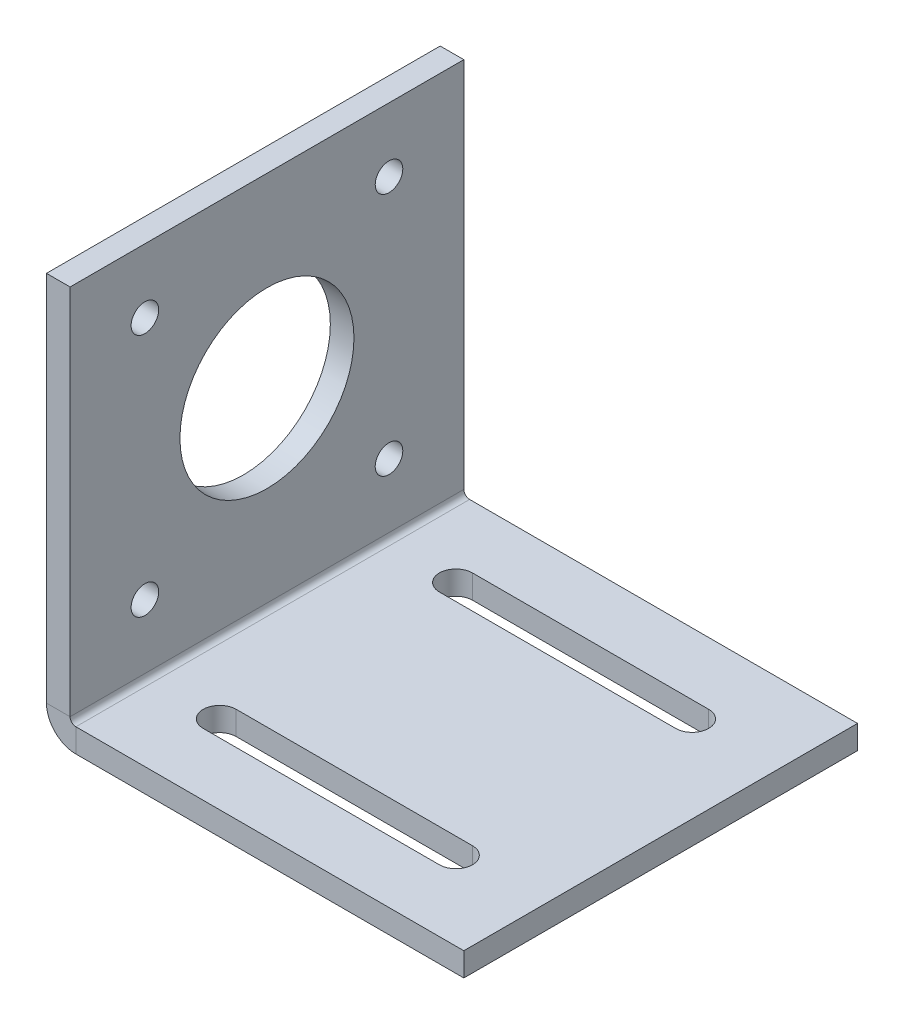
ISO-10303-21;
HEADER;
FILE_DESCRIPTION(('STEP AP214'),'2;1');
FILE_NAME('part.step','',(''),(''),'','','');
FILE_SCHEMA(('AUTOMOTIVE_DESIGN { 1 0 10303 214 1 1 1 1 }'));
ENDSEC;
DATA;
#1=APPLICATION_CONTEXT('core data for automotive mechanical design processes');
#2=APPLICATION_PROTOCOL_DEFINITION('international standard','automotive_design',2000,#1);
#3=PRODUCT_CONTEXT('',#1,'mechanical');
#4=PRODUCT('Part','Part','',(#3));
#5=PRODUCT_RELATED_PRODUCT_CATEGORY('part','',(#4));
#6=PRODUCT_DEFINITION_FORMATION('','',#4);
#7=PRODUCT_DEFINITION_CONTEXT('part definition',#1,'design');
#8=PRODUCT_DEFINITION('design','',#6,#7);
#9=PRODUCT_DEFINITION_SHAPE('','',#8);
#10=(LENGTH_UNIT() NAMED_UNIT(*) SI_UNIT(.MILLI.,.METRE.));
#11=(NAMED_UNIT(*) PLANE_ANGLE_UNIT() SI_UNIT($,.RADIAN.));
#12=(NAMED_UNIT(*) SI_UNIT($,.STERADIAN.) SOLID_ANGLE_UNIT());
#13=UNCERTAINTY_MEASURE_WITH_UNIT(LENGTH_MEASURE(1.E-05),#10,'distance_accuracy_value','');
#14=(GEOMETRIC_REPRESENTATION_CONTEXT(3) GLOBAL_UNCERTAINTY_ASSIGNED_CONTEXT((#13)) GLOBAL_UNIT_ASSIGNED_CONTEXT((#10,
#11,#12)) REPRESENTATION_CONTEXT('',''));
#15=CARTESIAN_POINT('',(0.,0.,0.));
#16=DIRECTION('',(0.,0.,1.));
#17=DIRECTION('',(1.,0.,0.));
#18=AXIS2_PLACEMENT_3D('',#15,#16,#17);
#19=CARTESIAN_POINT('',(0.7366,0.,50.));
#20=DIRECTION('',(0.,0.,1.));
#21=DIRECTION('',(1.,0.,0.));
#22=AXIS2_PLACEMENT_3D('',#19,#20,#21);
#23=PLANE('',#22);
#24=DIRECTION('',(0.,-1.,0.));
#25=VECTOR('',#24,1.);
#26=CARTESIAN_POINT('',(0.7366,0.,50.));
#27=LINE('',#26,#25);
#28=CARTESIAN_POINT('',(0.7366,0.,50.));
#29=VERTEX_POINT('',#28);
#30=CARTESIAN_POINT('',(0.7366,-3.,50.));
#31=VERTEX_POINT('',#30);
#32=EDGE_CURVE('E11',#29,#31,#27,.T.);
#33=ORIENTED_EDGE('',*,*,#32,.F.);
#34=CARTESIAN_POINT('',(0.7366,0.7366,50.));
#35=DIRECTION('',(0.,0.,-1.));
#36=DIRECTION('',(-1.,0.,0.));
#37=AXIS2_PLACEMENT_3D('',#34,#35,#36);
#38=CIRCLE('',#37,0.7366);
#39=CARTESIAN_POINT('',(0.,0.7366,50.));
#40=VERTEX_POINT('',#39);
#41=EDGE_CURVE('E245',#40,#29,#38,.F.);
#42=ORIENTED_EDGE('',*,*,#41,.F.);
#43=DIRECTION('',(1.,0.,0.));
#44=VECTOR('',#43,1.);
#45=CARTESIAN_POINT('',(-3.,0.7366,50.));
#46=LINE('',#45,#44);
#47=CARTESIAN_POINT('',(-3.,0.7366,50.));
#48=VERTEX_POINT('',#47);
#49=EDGE_CURVE('E45',#48,#40,#46,.T.);
#50=ORIENTED_EDGE('',*,*,#49,.F.);
#51=CARTESIAN_POINT('',(0.7366,0.7366,50.));
#52=DIRECTION('',(0.,0.,1.));
#53=DIRECTION('',(1.,0.,0.));
#54=AXIS2_PLACEMENT_3D('',#51,#52,#53);
#55=CIRCLE('',#54,3.7366);
#56=EDGE_CURVE('E257',#48,#31,#55,.T.);
#57=ORIENTED_EDGE('',*,*,#56,.T.);
#58=EDGE_LOOP('',(#33,#42,#50,#57));
#59=FACE_BOUND('',#58,.T.);
#60=ADVANCED_FACE('F37',(#59),#23,.T.);
#61=CARTESIAN_POINT('',(-3.,0.7366,50.));
#62=DIRECTION('',(0.,0.,1.));
#63=DIRECTION('',(1.,0.,0.));
#64=AXIS2_PLACEMENT_3D('',#61,#62,#63);
#65=PLANE('',#64);
#66=DIRECTION('',(1.,0.,0.));
#67=VECTOR('',#66,1.);
#68=CARTESIAN_POINT('',(0.,0.,50.));
#69=LINE('',#68,#67);
#70=CARTESIAN_POINT('',(50.,0.,50.));
#71=VERTEX_POINT('',#70);
#72=EDGE_CURVE('E242',#29,#71,#69,.T.);
#73=ORIENTED_EDGE('',*,*,#72,.F.);
#74=ORIENTED_EDGE('',*,*,#32,.T.);
#75=DIRECTION('',(1.,0.,0.));
#76=VECTOR('',#75,1.);
#77=CARTESIAN_POINT('',(0.,-3.,50.));
#78=LINE('',#77,#76);
#79=CARTESIAN_POINT('',(50.,-3.,50.));
#80=VERTEX_POINT('',#79);
#81=EDGE_CURVE('E236',#31,#80,#78,.T.);
#82=ORIENTED_EDGE('',*,*,#81,.T.);
#83=DIRECTION('',(0.,-1.,0.));
#84=VECTOR('',#83,1.);
#85=CARTESIAN_POINT('',(50.,0.,50.));
#86=LINE('',#85,#84);
#87=EDGE_CURVE('E238',#71,#80,#86,.T.);
#88=ORIENTED_EDGE('',*,*,#87,.F.);
#89=EDGE_LOOP('',(#73,#74,#82,#88));
#90=FACE_BOUND('',#89,.T.);
#91=ADVANCED_FACE('F340',(#90),#65,.T.);
#92=CARTESIAN_POINT('',(0.,0.7366,0.));
#93=DIRECTION('',(0.,0.,-1.));
#94=DIRECTION('',(-1.,0.,0.));
#95=AXIS2_PLACEMENT_3D('',#92,#93,#94);
#96=PLANE('',#95);
#97=DIRECTION('',(-1.,0.,0.));
#98=VECTOR('',#97,1.);
#99=CARTESIAN_POINT('',(0.,0.7366,0.));
#100=LINE('',#99,#98);
#101=CARTESIAN_POINT('',(0.,0.7366,0.));
#102=VERTEX_POINT('',#101);
#103=CARTESIAN_POINT('',(-3.,0.7366,0.));
#104=VERTEX_POINT('',#103);
#105=EDGE_CURVE('E305',#102,#104,#100,.T.);
#106=ORIENTED_EDGE('',*,*,#105,.F.);
#107=CARTESIAN_POINT('',(0.7366,0.7366,0.));
#108=DIRECTION('',(0.,0.,-1.));
#109=DIRECTION('',(-1.,0.,0.));
#110=AXIS2_PLACEMENT_3D('',#107,#108,#109);
#111=CIRCLE('',#110,0.7366);
#112=CARTESIAN_POINT('',(0.7366,0.,0.));
#113=VERTEX_POINT('',#112);
#114=EDGE_CURVE('E270',#102,#113,#111,.F.);
#115=ORIENTED_EDGE('',*,*,#114,.T.);
#116=DIRECTION('',(0.,1.,0.));
#117=VECTOR('',#116,1.);
#118=CARTESIAN_POINT('',(0.7366,-3.,0.));
#119=LINE('',#118,#117);
#120=CARTESIAN_POINT('',(0.7366,-3.,0.));
#121=VERTEX_POINT('',#120);
#122=EDGE_CURVE('E303',#121,#113,#119,.T.);
#123=ORIENTED_EDGE('',*,*,#122,.F.);
#124=CARTESIAN_POINT('',(0.7366,0.7366,0.));
#125=DIRECTION('',(0.,0.,1.));
#126=DIRECTION('',(1.,0.,0.));
#127=AXIS2_PLACEMENT_3D('',#124,#125,#126);
#128=CIRCLE('',#127,3.7366);
#129=EDGE_CURVE('E239',#104,#121,#128,.T.);
#130=ORIENTED_EDGE('',*,*,#129,.F.);
#131=EDGE_LOOP('',(#106,#115,#123,#130));
#132=FACE_BOUND('',#131,.T.);
#133=ADVANCED_FACE('F345',(#132),#96,.T.);
#134=CARTESIAN_POINT('',(0.7366,-3.,0.));
#135=DIRECTION('',(0.,0.,-1.));
#136=DIRECTION('',(-1.,0.,0.));
#137=AXIS2_PLACEMENT_3D('',#134,#135,#136);
#138=PLANE('',#137);
#139=DIRECTION('',(0.,-1.,0.));
#140=VECTOR('',#139,1.);
#141=CARTESIAN_POINT('',(0.,0.,0.));
#142=LINE('',#141,#140);
#143=CARTESIAN_POINT('',(0.,48.,0.));
#144=VERTEX_POINT('',#143);
#145=EDGE_CURVE('E273',#144,#102,#142,.T.);
#146=ORIENTED_EDGE('',*,*,#145,.T.);
#147=ORIENTED_EDGE('',*,*,#105,.T.);
#148=DIRECTION('',(0.,1.,0.));
#149=VECTOR('',#148,1.);
#150=CARTESIAN_POINT('',(-3.,0.,0.));
#151=LINE('',#150,#149);
#152=CARTESIAN_POINT('',(-3.,48.,0.));
#153=VERTEX_POINT('',#152);
#154=EDGE_CURVE('E279',#153,#104,#151,.F.);
#155=ORIENTED_EDGE('',*,*,#154,.F.);
#156=DIRECTION('',(1.,0.,0.));
#157=VECTOR('',#156,1.);
#158=CARTESIAN_POINT('',(-3.,48.,0.));
#159=LINE('',#158,#157);
#160=EDGE_CURVE('E276',#153,#144,#159,.T.);
#161=ORIENTED_EDGE('',*,*,#160,.T.);
#162=EDGE_LOOP('',(#146,#147,#155,#161));
#163=FACE_BOUND('',#162,.T.);
#164=ADVANCED_FACE('F388',(#163),#138,.T.);
#165=CARTESIAN_POINT('',(0.,-3.,50.));
#166=DIRECTION('',(0.,1.,0.));
#167=DIRECTION('',(0.,0.,1.));
#168=AXIS2_PLACEMENT_3D('',#165,#166,#167);
#169=PLANE('',#168);
#170=DIRECTION('',(1.,0.,0.));
#171=VECTOR('',#170,1.);
#172=CARTESIAN_POINT('',(0.,-3.,12.1));
#173=LINE('',#172,#171);
#174=CARTESIAN_POINT('',(9.00000000000001,-3.,12.1));
#175=VERTEX_POINT('',#174);
#176=CARTESIAN_POINT('',(39.,-3.,12.1));
#177=VERTEX_POINT('',#176);
#178=EDGE_CURVE('E181',#175,#177,#173,.T.);
#179=ORIENTED_EDGE('',*,*,#178,.T.);
#180=CARTESIAN_POINT('',(39.,-3.,10.));
#181=DIRECTION('',(0.,1.,0.));
#182=DIRECTION('',(0.,0.,1.));
#183=AXIS2_PLACEMENT_3D('',#180,#181,#182);
#184=CIRCLE('',#183,2.1);
#185=CARTESIAN_POINT('',(39.,-3.,7.9));
#186=VERTEX_POINT('',#185);
#187=EDGE_CURVE('E184',#177,#186,#184,.T.);
#188=ORIENTED_EDGE('',*,*,#187,.T.);
#189=DIRECTION('',(-1.,0.,0.));
#190=VECTOR('',#189,1.);
#191=CARTESIAN_POINT('',(0.,-3.,7.9));
#192=LINE('',#191,#190);
#193=CARTESIAN_POINT('',(9.00000000000001,-3.,7.9));
#194=VERTEX_POINT('',#193);
#195=EDGE_CURVE('E176',#186,#194,#192,.T.);
#196=ORIENTED_EDGE('',*,*,#195,.T.);
#197=CARTESIAN_POINT('',(9.00000000000001,-3.,10.));
#198=DIRECTION('',(0.,1.,0.));
#199=DIRECTION('',(0.,0.,1.));
#200=AXIS2_PLACEMENT_3D('',#197,#198,#199);
#201=CIRCLE('',#200,2.1);
#202=EDGE_CURVE('E156',#194,#175,#201,.T.);
#203=ORIENTED_EDGE('',*,*,#202,.T.);
#204=EDGE_LOOP('',(#179,#188,#196,#203));
#205=FACE_BOUND('',#204,.T.);
#206=DIRECTION('',(-1.,0.,0.));
#207=VECTOR('',#206,1.);
#208=CARTESIAN_POINT('',(0.,-3.,37.9));
#209=LINE('',#208,#207);
#210=CARTESIAN_POINT('',(39.,-3.,37.9));
#211=VERTEX_POINT('',#210);
#212=CARTESIAN_POINT('',(9.00000000000001,-3.,37.9));
#213=VERTEX_POINT('',#212);
#214=EDGE_CURVE('E213',#211,#213,#209,.T.);
#215=ORIENTED_EDGE('',*,*,#214,.T.);
#216=CARTESIAN_POINT('',(9.00000000000001,-3.,40.));
#217=DIRECTION('',(0.,1.,0.));
#218=DIRECTION('',(0.,0.,1.));
#219=AXIS2_PLACEMENT_3D('',#216,#217,#218);
#220=CIRCLE('',#219,2.1);
#221=CARTESIAN_POINT('',(9.00000000000001,-3.,42.1));
#222=VERTEX_POINT('',#221);
#223=EDGE_CURVE('E216',#213,#222,#220,.T.);
#224=ORIENTED_EDGE('',*,*,#223,.T.);
#225=DIRECTION('',(1.,0.,0.));
#226=VECTOR('',#225,1.);
#227=CARTESIAN_POINT('',(0.,-3.,42.1));
#228=LINE('',#227,#226);
#229=CARTESIAN_POINT('',(39.,-3.,42.1));
#230=VERTEX_POINT('',#229);
#231=EDGE_CURVE('E201',#222,#230,#228,.T.);
#232=ORIENTED_EDGE('',*,*,#231,.T.);
#233=CARTESIAN_POINT('',(39.,-3.,40.));
#234=DIRECTION('',(0.,1.,0.));
#235=DIRECTION('',(0.,0.,1.));
#236=AXIS2_PLACEMENT_3D('',#233,#234,#235);
#237=CIRCLE('',#236,2.1);
#238=EDGE_CURVE('E210',#230,#211,#237,.T.);
#239=ORIENTED_EDGE('',*,*,#238,.T.);
#240=EDGE_LOOP('',(#215,#224,#232,#239));
#241=FACE_BOUND('',#240,.T.);
#242=DIRECTION('',(1.,0.,0.));
#243=VECTOR('',#242,1.);
#244=CARTESIAN_POINT('',(0.,-3.,0.));
#245=LINE('',#244,#243);
#246=CARTESIAN_POINT('',(50.,-3.,0.));
#247=VERTEX_POINT('',#246);
#248=EDGE_CURVE('E261',#121,#247,#245,.T.);
#249=ORIENTED_EDGE('',*,*,#248,.T.);
#250=DIRECTION('',(0.,0.,-1.));
#251=VECTOR('',#250,1.);
#252=CARTESIAN_POINT('',(50.,-3.,50.));
#253=LINE('',#252,#251);
#254=EDGE_CURVE('E301',#80,#247,#253,.T.);
#255=ORIENTED_EDGE('',*,*,#254,.F.);
#256=ORIENTED_EDGE('',*,*,#81,.F.);
#257=DIRECTION('',(0.,0.,-1.));
#258=VECTOR('',#257,1.);
#259=CARTESIAN_POINT('',(0.7366,-3.,50.));
#260=LINE('',#259,#258);
#261=EDGE_CURVE('E260',#31,#121,#260,.T.);
#262=ORIENTED_EDGE('',*,*,#261,.T.);
#263=EDGE_LOOP('',(#249,#255,#256,#262));
#264=FACE_BOUND('',#263,.T.);
#265=ADVANCED_FACE('F380',(#205,#241,#264),#169,.F.);
#266=CARTESIAN_POINT('',(50.,0.,50.));
#267=DIRECTION('',(1.,0.,0.));
#268=DIRECTION('',(0.,0.,-1.));
#269=AXIS2_PLACEMENT_3D('',#266,#267,#268);
#270=PLANE('',#269);
#271=DIRECTION('',(0.,-1.,0.));
#272=VECTOR('',#271,1.);
#273=CARTESIAN_POINT('',(50.,0.,0.));
#274=LINE('',#273,#272);
#275=CARTESIAN_POINT('',(50.,0.,0.));
#276=VERTEX_POINT('',#275);
#277=EDGE_CURVE('E264',#276,#247,#274,.T.);
#278=ORIENTED_EDGE('',*,*,#277,.F.);
#279=DIRECTION('',(0.,0.,-1.));
#280=VECTOR('',#279,1.);
#281=CARTESIAN_POINT('',(50.,0.,50.));
#282=LINE('',#281,#280);
#283=EDGE_CURVE('E299',#71,#276,#282,.T.);
#284=ORIENTED_EDGE('',*,*,#283,.F.);
#285=ORIENTED_EDGE('',*,*,#87,.T.);
#286=ORIENTED_EDGE('',*,*,#254,.T.);
#287=EDGE_LOOP('',(#278,#284,#285,#286));
#288=FACE_BOUND('',#287,.T.);
#289=ADVANCED_FACE('F383',(#288),#270,.T.);
#290=CARTESIAN_POINT('',(0.,0.,50.));
#291=DIRECTION('',(0.,1.,0.));
#292=DIRECTION('',(0.,0.,1.));
#293=AXIS2_PLACEMENT_3D('',#290,#291,#292);
#294=PLANE('',#293);
#295=CARTESIAN_POINT('',(39.,0.,10.));
#296=DIRECTION('',(0.,1.,0.));
#297=DIRECTION('',(0.,0.,-1.));
#298=AXIS2_PLACEMENT_3D('',#295,#296,#297);
#299=CIRCLE('',#298,2.1);
#300=CARTESIAN_POINT('',(39.,0.,12.1));
#301=VERTEX_POINT('',#300);
#302=CARTESIAN_POINT('',(39.,0.,7.9));
#303=VERTEX_POINT('',#302);
#304=EDGE_CURVE('E61',#301,#303,#299,.T.);
#305=ORIENTED_EDGE('',*,*,#304,.F.);
#306=DIRECTION('',(1.,0.,0.));
#307=VECTOR('',#306,1.);
#308=CARTESIAN_POINT('',(9.00000000000001,0.,12.1));
#309=LINE('',#308,#307);
#310=CARTESIAN_POINT('',(9.00000000000001,0.,12.1));
#311=VERTEX_POINT('',#310);
#312=EDGE_CURVE('E169',#311,#301,#309,.T.);
#313=ORIENTED_EDGE('',*,*,#312,.F.);
#314=CARTESIAN_POINT('',(9.00000000000001,0.,10.));
#315=DIRECTION('',(0.,1.,0.));
#316=DIRECTION('',(0.,0.,-1.));
#317=AXIS2_PLACEMENT_3D('',#314,#315,#316);
#318=CIRCLE('',#317,2.1);
#319=CARTESIAN_POINT('',(9.00000000000001,0.,7.9));
#320=VERTEX_POINT('',#319);
#321=EDGE_CURVE('E153',#320,#311,#318,.T.);
#322=ORIENTED_EDGE('',*,*,#321,.F.);
#323=DIRECTION('',(-1.,0.,0.));
#324=VECTOR('',#323,1.);
#325=CARTESIAN_POINT('',(9.00000000000001,0.,7.9));
#326=LINE('',#325,#324);
#327=EDGE_CURVE('E162',#303,#320,#326,.T.);
#328=ORIENTED_EDGE('',*,*,#327,.F.);
#329=EDGE_LOOP('',(#305,#313,#322,#328));
#330=FACE_BOUND('',#329,.T.);
#331=CARTESIAN_POINT('',(9.00000000000001,0.,40.));
#332=DIRECTION('',(0.,1.,0.));
#333=DIRECTION('',(0.,0.,1.));
#334=AXIS2_PLACEMENT_3D('',#331,#332,#333);
#335=CIRCLE('',#334,2.1);
#336=CARTESIAN_POINT('',(9.00000000000001,0.,37.9));
#337=VERTEX_POINT('',#336);
#338=CARTESIAN_POINT('',(9.00000000000001,0.,42.1));
#339=VERTEX_POINT('',#338);
#340=EDGE_CURVE('E187',#337,#339,#335,.T.);
#341=ORIENTED_EDGE('',*,*,#340,.F.);
#342=DIRECTION('',(-1.,0.,0.));
#343=VECTOR('',#342,1.);
#344=CARTESIAN_POINT('',(9.00000000000001,0.,37.9));
#345=LINE('',#344,#343);
#346=CARTESIAN_POINT('',(39.,0.,37.9));
#347=VERTEX_POINT('',#346);
#348=EDGE_CURVE('E195',#347,#337,#345,.T.);
#349=ORIENTED_EDGE('',*,*,#348,.F.);
#350=CARTESIAN_POINT('',(39.,0.,40.));
#351=DIRECTION('',(0.,1.,0.));
#352=DIRECTION('',(0.,0.,1.));
#353=AXIS2_PLACEMENT_3D('',#350,#351,#352);
#354=CIRCLE('',#353,2.1);
#355=CARTESIAN_POINT('',(39.,0.,42.1));
#356=VERTEX_POINT('',#355);
#357=EDGE_CURVE('E192',#356,#347,#354,.T.);
#358=ORIENTED_EDGE('',*,*,#357,.F.);
#359=DIRECTION('',(1.,0.,0.));
#360=VECTOR('',#359,1.);
#361=CARTESIAN_POINT('',(9.00000000000001,0.,42.1));
#362=LINE('',#361,#360);
#363=EDGE_CURVE('E189',#339,#356,#362,.T.);
#364=ORIENTED_EDGE('',*,*,#363,.F.);
#365=EDGE_LOOP('',(#341,#349,#358,#364));
#366=FACE_BOUND('',#365,.T.);
#367=DIRECTION('',(1.,0.,0.));
#368=VECTOR('',#367,1.);
#369=CARTESIAN_POINT('',(0.,0.,0.));
#370=LINE('',#369,#368);
#371=EDGE_CURVE('E267',#113,#276,#370,.T.);
#372=ORIENTED_EDGE('',*,*,#371,.F.);
#373=DIRECTION('',(0.,0.,-1.));
#374=VECTOR('',#373,1.);
#375=CARTESIAN_POINT('',(0.7366,0.,50.));
#376=LINE('',#375,#374);
#377=EDGE_CURVE('E296',#29,#113,#376,.T.);
#378=ORIENTED_EDGE('',*,*,#377,.F.);
#379=ORIENTED_EDGE('',*,*,#72,.T.);
#380=ORIENTED_EDGE('',*,*,#283,.T.);
#381=EDGE_LOOP('',(#372,#378,#379,#380));
#382=FACE_BOUND('',#381,.T.);
#383=ADVANCED_FACE('F166',(#330,#366,#382),#294,.T.);
#384=CARTESIAN_POINT('',(0.7366,0.7366,50.));
#385=DIRECTION('',(0.,0.,-1.));
#386=DIRECTION('',(-1.,0.,0.));
#387=AXIS2_PLACEMENT_3D('',#384,#385,#386);
#388=CYLINDRICAL_SURFACE('',#387,0.7366);
#389=ORIENTED_EDGE('',*,*,#114,.F.);
#390=DIRECTION('',(0.,0.,-1.));
#391=VECTOR('',#390,1.);
#392=CARTESIAN_POINT('',(0.,0.7366,50.));
#393=LINE('',#392,#391);
#394=EDGE_CURVE('E293',#40,#102,#393,.T.);
#395=ORIENTED_EDGE('',*,*,#394,.F.);
#396=ORIENTED_EDGE('',*,*,#41,.T.);
#397=ORIENTED_EDGE('',*,*,#377,.T.);
#398=EDGE_LOOP('',(#389,#395,#396,#397));
#399=FACE_BOUND('',#398,.T.);
#400=ADVANCED_FACE('F358',(#399),#388,.F.);
#401=CARTESIAN_POINT('',(0.,0.,50.));
#402=DIRECTION('',(1.,0.,0.));
#403=DIRECTION('',(0.,0.,-1.));
#404=AXIS2_PLACEMENT_3D('',#401,#402,#403);
#405=PLANE('',#404);
#406=CARTESIAN_POINT('',(0.,39.8683,40.5));
#407=DIRECTION('',(1.,0.,0.));
#408=DIRECTION('',(0.,0.,-1.));
#409=AXIS2_PLACEMENT_3D('',#406,#407,#408);
#410=CIRCLE('',#409,1.75);
#411=CARTESIAN_POINT('',(0.,39.8683,38.75));
#412=VERTEX_POINT('',#411);
#413=EDGE_CURVE('E220',#412,#412,#410,.T.);
#414=ORIENTED_EDGE('',*,*,#413,.F.);
#415=EDGE_LOOP('',(#414));
#416=FACE_BOUND('',#415,.T.);
#417=CARTESIAN_POINT('',(0.,39.8683,9.5));
#418=DIRECTION('',(1.,0.,0.));
#419=DIRECTION('',(0.,0.,1.));
#420=AXIS2_PLACEMENT_3D('',#417,#418,#419);
#421=CIRCLE('',#420,1.75);
#422=CARTESIAN_POINT('',(0.,39.8683,11.25));
#423=VERTEX_POINT('',#422);
#424=EDGE_CURVE('E224',#423,#423,#421,.T.);
#425=ORIENTED_EDGE('',*,*,#424,.F.);
#426=EDGE_LOOP('',(#425));
#427=FACE_BOUND('',#426,.T.);
#428=CARTESIAN_POINT('',(0.,8.8683,40.5));
#429=DIRECTION('',(1.,0.,0.));
#430=DIRECTION('',(0.,0.,1.));
#431=AXIS2_PLACEMENT_3D('',#428,#429,#430);
#432=CIRCLE('',#431,1.75);
#433=CARTESIAN_POINT('',(0.,8.8683,42.25));
#434=VERTEX_POINT('',#433);
#435=EDGE_CURVE('E227',#434,#434,#432,.T.);
#436=ORIENTED_EDGE('',*,*,#435,.F.);
#437=EDGE_LOOP('',(#436));
#438=FACE_BOUND('',#437,.T.);
#439=CARTESIAN_POINT('',(0.,8.8683,9.5));
#440=DIRECTION('',(1.,0.,0.));
#441=DIRECTION('',(0.,0.,-1.));
#442=AXIS2_PLACEMENT_3D('',#439,#440,#441);
#443=CIRCLE('',#442,1.75);
#444=CARTESIAN_POINT('',(0.,8.8683,7.75));
#445=VERTEX_POINT('',#444);
#446=EDGE_CURVE('E219',#445,#445,#443,.T.);
#447=ORIENTED_EDGE('',*,*,#446,.F.);
#448=EDGE_LOOP('',(#447));
#449=FACE_BOUND('',#448,.T.);
#450=CARTESIAN_POINT('',(0.,24.3683,25.));
#451=DIRECTION('',(1.,0.,0.));
#452=DIRECTION('',(0.,0.,-1.));
#453=AXIS2_PLACEMENT_3D('',#450,#451,#452);
#454=CIRCLE('',#453,11.05);
#455=CARTESIAN_POINT('',(0.,24.3683,13.95));
#456=VERTEX_POINT('',#455);
#457=EDGE_CURVE('E232',#456,#456,#454,.T.);
#458=ORIENTED_EDGE('',*,*,#457,.F.);
#459=EDGE_LOOP('',(#458));
#460=FACE_BOUND('',#459,.T.);
#461=ORIENTED_EDGE('',*,*,#145,.F.);
#462=DIRECTION('',(0.,0.,-1.));
#463=VECTOR('',#462,1.);
#464=CARTESIAN_POINT('',(0.,48.,50.));
#465=LINE('',#464,#463);
#466=CARTESIAN_POINT('',(0.,48.,50.));
#467=VERTEX_POINT('',#466);
#468=EDGE_CURVE('E291',#467,#144,#465,.T.);
#469=ORIENTED_EDGE('',*,*,#468,.F.);
#470=DIRECTION('',(0.,-1.,0.));
#471=VECTOR('',#470,1.);
#472=CARTESIAN_POINT('',(0.,0.,50.));
#473=LINE('',#472,#471);
#474=EDGE_CURVE('E248',#467,#40,#473,.T.);
#475=ORIENTED_EDGE('',*,*,#474,.T.);
#476=ORIENTED_EDGE('',*,*,#394,.T.);
#477=EDGE_LOOP('',(#461,#469,#475,#476));
#478=FACE_BOUND('',#477,.T.);
#479=ADVANCED_FACE('F361',(#416,#427,#438,#449,#460,#478),#405,.T.);
#480=CARTESIAN_POINT('',(-3.,48.,50.));
#481=DIRECTION('',(0.,1.,0.));
#482=DIRECTION('',(0.,0.,1.));
#483=AXIS2_PLACEMENT_3D('',#480,#481,#482);
#484=PLANE('',#483);
#485=ORIENTED_EDGE('',*,*,#160,.F.);
#486=DIRECTION('',(0.,0.,-1.));
#487=VECTOR('',#486,1.);
#488=CARTESIAN_POINT('',(-3.,48.,50.));
#489=LINE('',#488,#487);
#490=CARTESIAN_POINT('',(-3.,48.,50.));
#491=VERTEX_POINT('',#490);
#492=EDGE_CURVE('E289',#491,#153,#489,.T.);
#493=ORIENTED_EDGE('',*,*,#492,.F.);
#494=DIRECTION('',(1.,0.,0.));
#495=VECTOR('',#494,1.);
#496=CARTESIAN_POINT('',(-3.,48.,50.));
#497=LINE('',#496,#495);
#498=EDGE_CURVE('E251',#491,#467,#497,.T.);
#499=ORIENTED_EDGE('',*,*,#498,.T.);
#500=ORIENTED_EDGE('',*,*,#468,.T.);
#501=EDGE_LOOP('',(#485,#493,#499,#500));
#502=FACE_BOUND('',#501,.T.);
#503=ADVANCED_FACE('F368',(#502),#484,.T.);
#504=CARTESIAN_POINT('',(-3.,0.,50.));
#505=DIRECTION('',(1.,0.,0.));
#506=DIRECTION('',(0.,0.,-1.));
#507=AXIS2_PLACEMENT_3D('',#504,#505,#506);
#508=PLANE('',#507);
#509=CARTESIAN_POINT('',(-3.,39.8683,40.5));
#510=DIRECTION('',(1.,0.,0.));
#511=DIRECTION('',(0.,0.,-1.));
#512=AXIS2_PLACEMENT_3D('',#509,#510,#511);
#513=CIRCLE('',#512,1.75);
#514=CARTESIAN_POINT('',(-3.,39.8683,38.75));
#515=VERTEX_POINT('',#514);
#516=EDGE_CURVE('E40',#515,#515,#513,.T.);
#517=ORIENTED_EDGE('',*,*,#516,.T.);
#518=EDGE_LOOP('',(#517));
#519=FACE_BOUND('',#518,.T.);
#520=CARTESIAN_POINT('',(-3.,39.8683,9.5));
#521=DIRECTION('',(1.,0.,0.));
#522=DIRECTION('',(0.,0.,-1.));
#523=AXIS2_PLACEMENT_3D('',#520,#521,#522);
#524=CIRCLE('',#523,1.75);
#525=CARTESIAN_POINT('',(-3.,39.8683,7.75));
#526=VERTEX_POINT('',#525);
#527=EDGE_CURVE('E314',#526,#526,#524,.T.);
#528=ORIENTED_EDGE('',*,*,#527,.T.);
#529=EDGE_LOOP('',(#528));
#530=FACE_BOUND('',#529,.T.);
#531=CARTESIAN_POINT('',(-3.,8.8683,40.5));
#532=DIRECTION('',(1.,0.,0.));
#533=DIRECTION('',(0.,0.,-1.));
#534=AXIS2_PLACEMENT_3D('',#531,#532,#533);
#535=CIRCLE('',#534,1.75);
#536=CARTESIAN_POINT('',(-3.,8.8683,38.75));
#537=VERTEX_POINT('',#536);
#538=EDGE_CURVE('E312',#537,#537,#535,.T.);
#539=ORIENTED_EDGE('',*,*,#538,.T.);
#540=EDGE_LOOP('',(#539));
#541=FACE_BOUND('',#540,.T.);
#542=CARTESIAN_POINT('',(-3.,8.8683,9.5));
#543=DIRECTION('',(1.,0.,0.));
#544=DIRECTION('',(0.,0.,-1.));
#545=AXIS2_PLACEMENT_3D('',#542,#543,#544);
#546=CIRCLE('',#545,1.75);
#547=CARTESIAN_POINT('',(-3.,8.8683,7.75));
#548=VERTEX_POINT('',#547);
#549=EDGE_CURVE('E223',#548,#548,#546,.T.);
#550=ORIENTED_EDGE('',*,*,#549,.T.);
#551=EDGE_LOOP('',(#550));
#552=FACE_BOUND('',#551,.T.);
#553=CARTESIAN_POINT('',(-3.,24.3683,25.));
#554=DIRECTION('',(1.,0.,0.));
#555=DIRECTION('',(0.,0.,-1.));
#556=AXIS2_PLACEMENT_3D('',#553,#554,#555);
#557=CIRCLE('',#556,11.05);
#558=CARTESIAN_POINT('',(-3.,24.3683,13.95));
#559=VERTEX_POINT('',#558);
#560=EDGE_CURVE('E235',#559,#559,#557,.T.);
#561=ORIENTED_EDGE('',*,*,#560,.T.);
#562=EDGE_LOOP('',(#561));
#563=FACE_BOUND('',#562,.T.);
#564=ORIENTED_EDGE('',*,*,#154,.T.);
#565=DIRECTION('',(0.,0.,-1.));
#566=VECTOR('',#565,1.);
#567=CARTESIAN_POINT('',(-3.,0.7366,50.));
#568=LINE('',#567,#566);
#569=EDGE_CURVE('E286',#48,#104,#568,.T.);
#570=ORIENTED_EDGE('',*,*,#569,.F.);
#571=DIRECTION('',(0.,1.,0.));
#572=VECTOR('',#571,1.);
#573=CARTESIAN_POINT('',(-3.,0.,50.));
#574=LINE('',#573,#572);
#575=EDGE_CURVE('E254',#491,#48,#574,.F.);
#576=ORIENTED_EDGE('',*,*,#575,.F.);
#577=ORIENTED_EDGE('',*,*,#492,.T.);
#578=EDGE_LOOP('',(#564,#570,#576,#577));
#579=FACE_BOUND('',#578,.T.);
#580=ADVANCED_FACE('F321',(#519,#530,#541,#552,#563,#579),#508,.F.);
#581=CARTESIAN_POINT('',(0.7366,0.7366,50.));
#582=DIRECTION('',(0.,0.,-1.));
#583=DIRECTION('',(-1.,0.,0.));
#584=AXIS2_PLACEMENT_3D('',#581,#582,#583);
#585=CYLINDRICAL_SURFACE('',#584,3.7366);
#586=ORIENTED_EDGE('',*,*,#129,.T.);
#587=ORIENTED_EDGE('',*,*,#261,.F.);
#588=ORIENTED_EDGE('',*,*,#56,.F.);
#589=ORIENTED_EDGE('',*,*,#569,.T.);
#590=EDGE_LOOP('',(#586,#587,#588,#589));
#591=FACE_BOUND('',#590,.T.);
#592=ADVANCED_FACE('F375',(#591),#585,.T.);
#593=CARTESIAN_POINT('',(0.7366,0.7366,50.));
#594=DIRECTION('',(0.,0.,-1.));
#595=DIRECTION('',(-1.,0.,0.));
#596=AXIS2_PLACEMENT_3D('',#593,#594,#595);
#597=PLANE('',#596);
#598=ORIENTED_EDGE('',*,*,#575,.T.);
#599=ORIENTED_EDGE('',*,*,#49,.T.);
#600=ORIENTED_EDGE('',*,*,#474,.F.);
#601=ORIENTED_EDGE('',*,*,#498,.F.);
#602=EDGE_LOOP('',(#598,#599,#600,#601));
#603=FACE_BOUND('',#602,.T.);
#604=ADVANCED_FACE('F365',(#603),#597,.F.);
#605=CARTESIAN_POINT('',(0.7366,0.7366,0.));
#606=DIRECTION('',(0.,0.,-1.));
#607=DIRECTION('',(-1.,0.,0.));
#608=AXIS2_PLACEMENT_3D('',#605,#606,#607);
#609=PLANE('',#608);
#610=ORIENTED_EDGE('',*,*,#248,.F.);
#611=ORIENTED_EDGE('',*,*,#122,.T.);
#612=ORIENTED_EDGE('',*,*,#371,.T.);
#613=ORIENTED_EDGE('',*,*,#277,.T.);
#614=EDGE_LOOP('',(#610,#611,#612,#613));
#615=FACE_BOUND('',#614,.T.);
#616=ADVANCED_FACE('F385',(#615),#609,.T.);
#617=CARTESIAN_POINT('',(-10.,24.3683,25.));
#618=DIRECTION('',(1.,0.,0.));
#619=DIRECTION('',(0.,0.,-1.));
#620=AXIS2_PLACEMENT_3D('',#617,#618,#619);
#621=CYLINDRICAL_SURFACE('',#620,11.05);
#622=ORIENTED_EDGE('',*,*,#457,.T.);
#623=EDGE_LOOP('',(#622));
#624=FACE_BOUND('',#623,.T.);
#625=ORIENTED_EDGE('',*,*,#560,.F.);
#626=EDGE_LOOP('',(#625));
#627=FACE_BOUND('',#626,.T.);
#628=ADVANCED_FACE('F417',(#624,#627),#621,.F.);
#629=CARTESIAN_POINT('',(-10.,8.8683,9.5));
#630=DIRECTION('',(1.,0.,0.));
#631=DIRECTION('',(0.,0.,-1.));
#632=AXIS2_PLACEMENT_3D('',#629,#630,#631);
#633=CYLINDRICAL_SURFACE('',#632,1.75);
#634=ORIENTED_EDGE('',*,*,#446,.T.);
#635=EDGE_LOOP('',(#634));
#636=FACE_BOUND('',#635,.T.);
#637=ORIENTED_EDGE('',*,*,#549,.F.);
#638=EDGE_LOOP('',(#637));
#639=FACE_BOUND('',#638,.T.);
#640=ADVANCED_FACE('F422',(#636,#639),#633,.F.);
#641=CARTESIAN_POINT('',(-10.,8.8683,40.5));
#642=DIRECTION('',(1.,0.,0.));
#643=DIRECTION('',(0.,0.,-1.));
#644=AXIS2_PLACEMENT_3D('',#641,#642,#643);
#645=CYLINDRICAL_SURFACE('',#644,1.75);
#646=ORIENTED_EDGE('',*,*,#435,.T.);
#647=EDGE_LOOP('',(#646));
#648=FACE_BOUND('',#647,.T.);
#649=ORIENTED_EDGE('',*,*,#538,.F.);
#650=EDGE_LOOP('',(#649));
#651=FACE_BOUND('',#650,.T.);
#652=ADVANCED_FACE('F336',(#648,#651),#645,.F.);
#653=CARTESIAN_POINT('',(-10.,39.8683,9.5));
#654=DIRECTION('',(1.,0.,0.));
#655=DIRECTION('',(0.,0.,-1.));
#656=AXIS2_PLACEMENT_3D('',#653,#654,#655);
#657=CYLINDRICAL_SURFACE('',#656,1.75);
#658=ORIENTED_EDGE('',*,*,#424,.T.);
#659=EDGE_LOOP('',(#658));
#660=FACE_BOUND('',#659,.T.);
#661=ORIENTED_EDGE('',*,*,#527,.F.);
#662=EDGE_LOOP('',(#661));
#663=FACE_BOUND('',#662,.T.);
#664=ADVANCED_FACE('F326',(#660,#663),#657,.F.);
#665=CARTESIAN_POINT('',(-10.,39.8683,40.5));
#666=DIRECTION('',(1.,0.,0.));
#667=DIRECTION('',(0.,0.,-1.));
#668=AXIS2_PLACEMENT_3D('',#665,#666,#667);
#669=CYLINDRICAL_SURFACE('',#668,1.75);
#670=ORIENTED_EDGE('',*,*,#413,.T.);
#671=EDGE_LOOP('',(#670));
#672=FACE_BOUND('',#671,.T.);
#673=ORIENTED_EDGE('',*,*,#516,.F.);
#674=EDGE_LOOP('',(#673));
#675=FACE_BOUND('',#674,.T.);
#676=ADVANCED_FACE('F323',(#672,#675),#669,.F.);
#677=CARTESIAN_POINT('',(9.00000000000001,-10.,40.));
#678=DIRECTION('',(0.,1.,0.));
#679=DIRECTION('',(0.,0.,1.));
#680=AXIS2_PLACEMENT_3D('',#677,#678,#679);
#681=CYLINDRICAL_SURFACE('',#680,2.1);
#682=DIRECTION('',(0.,1.,0.));
#683=VECTOR('',#682,1.);
#684=CARTESIAN_POINT('',(9.00000000000001,-10.,37.9));
#685=LINE('',#684,#683);
#686=EDGE_CURVE('E199',#213,#337,#685,.T.);
#687=ORIENTED_EDGE('',*,*,#686,.T.);
#688=ORIENTED_EDGE('',*,*,#340,.T.);
#689=DIRECTION('',(0.,1.,0.));
#690=VECTOR('',#689,1.);
#691=CARTESIAN_POINT('',(9.00000000000001,-10.,42.1));
#692=LINE('',#691,#690);
#693=EDGE_CURVE('E198',#222,#339,#692,.T.);
#694=ORIENTED_EDGE('',*,*,#693,.F.);
#695=ORIENTED_EDGE('',*,*,#223,.F.);
#696=EDGE_LOOP('',(#687,#688,#694,#695));
#697=FACE_BOUND('',#696,.T.);
#698=ADVANCED_FACE('F325',(#697),#681,.F.);
#699=CARTESIAN_POINT('',(9.00000000000001,-10.,37.9));
#700=DIRECTION('',(0.,0.,-1.));
#701=DIRECTION('',(-1.,0.,0.));
#702=AXIS2_PLACEMENT_3D('',#699,#700,#701);
#703=PLANE('',#702);
#704=DIRECTION('',(0.,1.,0.));
#705=VECTOR('',#704,1.);
#706=CARTESIAN_POINT('',(39.,-10.,37.9));
#707=LINE('',#706,#705);
#708=EDGE_CURVE('E202',#211,#347,#707,.T.);
#709=ORIENTED_EDGE('',*,*,#708,.T.);
#710=ORIENTED_EDGE('',*,*,#348,.T.);
#711=ORIENTED_EDGE('',*,*,#686,.F.);
#712=ORIENTED_EDGE('',*,*,#214,.F.);
#713=EDGE_LOOP('',(#709,#710,#711,#712));
#714=FACE_BOUND('',#713,.T.);
#715=ADVANCED_FACE('F333',(#714),#703,.F.);
#716=CARTESIAN_POINT('',(39.,-10.,40.));
#717=DIRECTION('',(0.,1.,0.));
#718=DIRECTION('',(0.,0.,1.));
#719=AXIS2_PLACEMENT_3D('',#716,#717,#718);
#720=CYLINDRICAL_SURFACE('',#719,2.1);
#721=DIRECTION('',(0.,1.,0.));
#722=VECTOR('',#721,1.);
#723=CARTESIAN_POINT('',(39.,-10.,42.1));
#724=LINE('',#723,#722);
#725=EDGE_CURVE('E204',#230,#356,#724,.T.);
#726=ORIENTED_EDGE('',*,*,#725,.T.);
#727=ORIENTED_EDGE('',*,*,#357,.T.);
#728=ORIENTED_EDGE('',*,*,#708,.F.);
#729=ORIENTED_EDGE('',*,*,#238,.F.);
#730=EDGE_LOOP('',(#726,#727,#728,#729));
#731=FACE_BOUND('',#730,.T.);
#732=ADVANCED_FACE('F481',(#731),#720,.F.);
#733=CARTESIAN_POINT('',(9.00000000000001,-10.,42.1));
#734=DIRECTION('',(0.,0.,1.));
#735=DIRECTION('',(1.,0.,0.));
#736=AXIS2_PLACEMENT_3D('',#733,#734,#735);
#737=PLANE('',#736);
#738=ORIENTED_EDGE('',*,*,#693,.T.);
#739=ORIENTED_EDGE('',*,*,#363,.T.);
#740=ORIENTED_EDGE('',*,*,#725,.F.);
#741=ORIENTED_EDGE('',*,*,#231,.F.);
#742=EDGE_LOOP('',(#738,#739,#740,#741));
#743=FACE_BOUND('',#742,.T.);
#744=ADVANCED_FACE('F492',(#743),#737,.F.);
#745=CARTESIAN_POINT('',(39.,-10.,10.));
#746=DIRECTION('',(0.,1.,0.));
#747=DIRECTION('',(0.,0.,1.));
#748=AXIS2_PLACEMENT_3D('',#745,#746,#747);
#749=CYLINDRICAL_SURFACE('',#748,2.1);
#750=DIRECTION('',(0.,1.,0.));
#751=VECTOR('',#750,1.);
#752=CARTESIAN_POINT('',(39.,-10.,12.1));
#753=LINE('',#752,#751);
#754=EDGE_CURVE('E174',#177,#301,#753,.T.);
#755=ORIENTED_EDGE('',*,*,#754,.T.);
#756=ORIENTED_EDGE('',*,*,#304,.T.);
#757=DIRECTION('',(0.,1.,0.));
#758=VECTOR('',#757,1.);
#759=CARTESIAN_POINT('',(39.,-10.,7.9));
#760=LINE('',#759,#758);
#761=EDGE_CURVE('E159',#186,#303,#760,.T.);
#762=ORIENTED_EDGE('',*,*,#761,.F.);
#763=ORIENTED_EDGE('',*,*,#187,.F.);
#764=EDGE_LOOP('',(#755,#756,#762,#763));
#765=FACE_BOUND('',#764,.T.);
#766=ADVANCED_FACE('F503',(#765),#749,.F.);
#767=CARTESIAN_POINT('',(9.00000000000001,-10.,12.1));
#768=DIRECTION('',(0.,0.,1.));
#769=DIRECTION('',(1.,0.,0.));
#770=AXIS2_PLACEMENT_3D('',#767,#768,#769);
#771=PLANE('',#770);
#772=DIRECTION('',(0.,1.,0.));
#773=VECTOR('',#772,1.);
#774=CARTESIAN_POINT('',(9.00000000000001,-10.,12.1));
#775=LINE('',#774,#773);
#776=EDGE_CURVE('E158',#175,#311,#775,.T.);
#777=ORIENTED_EDGE('',*,*,#776,.T.);
#778=ORIENTED_EDGE('',*,*,#312,.T.);
#779=ORIENTED_EDGE('',*,*,#754,.F.);
#780=ORIENTED_EDGE('',*,*,#178,.F.);
#781=EDGE_LOOP('',(#777,#778,#779,#780));
#782=FACE_BOUND('',#781,.T.);
#783=ADVANCED_FACE('F514',(#782),#771,.F.);
#784=CARTESIAN_POINT('',(9.00000000000001,-10.,10.));
#785=DIRECTION('',(0.,1.,0.));
#786=DIRECTION('',(0.,0.,1.));
#787=AXIS2_PLACEMENT_3D('',#784,#785,#786);
#788=CYLINDRICAL_SURFACE('',#787,2.1);
#789=DIRECTION('',(0.,1.,0.));
#790=VECTOR('',#789,1.);
#791=CARTESIAN_POINT('',(9.00000000000001,-10.,7.9));
#792=LINE('',#791,#790);
#793=EDGE_CURVE('E53',#194,#320,#792,.T.);
#794=ORIENTED_EDGE('',*,*,#793,.T.);
#795=ORIENTED_EDGE('',*,*,#321,.T.);
#796=ORIENTED_EDGE('',*,*,#776,.F.);
#797=ORIENTED_EDGE('',*,*,#202,.F.);
#798=EDGE_LOOP('',(#794,#795,#796,#797));
#799=FACE_BOUND('',#798,.T.);
#800=ADVANCED_FACE('F150',(#799),#788,.F.);
#801=CARTESIAN_POINT('',(9.00000000000001,-10.,7.9));
#802=DIRECTION('',(0.,0.,-1.));
#803=DIRECTION('',(-1.,0.,0.));
#804=AXIS2_PLACEMENT_3D('',#801,#802,#803);
#805=PLANE('',#804);
#806=ORIENTED_EDGE('',*,*,#761,.T.);
#807=ORIENTED_EDGE('',*,*,#327,.T.);
#808=ORIENTED_EDGE('',*,*,#793,.F.);
#809=ORIENTED_EDGE('',*,*,#195,.F.);
#810=EDGE_LOOP('',(#806,#807,#808,#809));
#811=FACE_BOUND('',#810,.T.);
#812=ADVANCED_FACE('F163',(#811),#805,.F.);
#813=CLOSED_SHELL('',(#60,#91,#133,#164,#265,#289,#383,#400,#479,#503,#580,#592,#604,#616,#628,
#640,#652,#664,#676,#698,#715,#732,#744,#766,#783,#800,#812));
#814=MANIFOLD_SOLID_BREP('B2',#813);
#815=ADVANCED_BREP_SHAPE_REPRESENTATION('',(#18,#814),#14);
#816=SHAPE_DEFINITION_REPRESENTATION(#9,#815);
ENDSEC;
END-ISO-10303-21;
